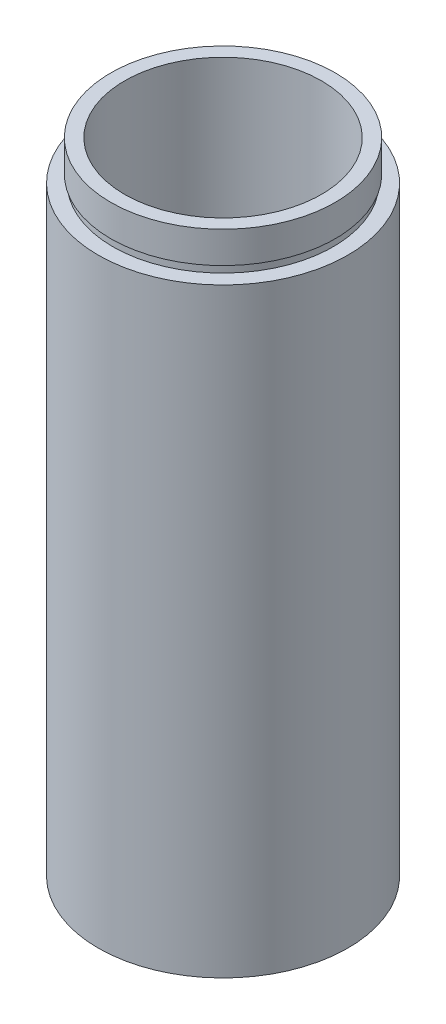
ISO-10303-21;
HEADER;
FILE_DESCRIPTION(('STEP AP214'),'2;1');
FILE_NAME('part.step','',(''),(''),'','','');
FILE_SCHEMA(('AUTOMOTIVE_DESIGN { 1 0 10303 214 1 1 1 1 }'));
ENDSEC;
DATA;
#1=APPLICATION_CONTEXT('core data for automotive mechanical design processes');
#2=APPLICATION_PROTOCOL_DEFINITION('international standard','automotive_design',2000,#1);
#3=PRODUCT_CONTEXT('',#1,'mechanical');
#4=PRODUCT('Part','Part','',(#3));
#5=PRODUCT_RELATED_PRODUCT_CATEGORY('part','',(#4));
#6=PRODUCT_DEFINITION_FORMATION('','',#4);
#7=PRODUCT_DEFINITION_CONTEXT('part definition',#1,'design');
#8=PRODUCT_DEFINITION('design','',#6,#7);
#9=PRODUCT_DEFINITION_SHAPE('','',#8);
#10=(LENGTH_UNIT() NAMED_UNIT(*) SI_UNIT(.MILLI.,.METRE.));
#11=(NAMED_UNIT(*) PLANE_ANGLE_UNIT() SI_UNIT($,.RADIAN.));
#12=(NAMED_UNIT(*) SI_UNIT($,.STERADIAN.) SOLID_ANGLE_UNIT());
#13=UNCERTAINTY_MEASURE_WITH_UNIT(LENGTH_MEASURE(1.E-05),#10,'distance_accuracy_value','');
#14=(GEOMETRIC_REPRESENTATION_CONTEXT(3) GLOBAL_UNCERTAINTY_ASSIGNED_CONTEXT((#13)) GLOBAL_UNIT_ASSIGNED_CONTEXT((#10,
#11,#12)) REPRESENTATION_CONTEXT('',''));
#15=CARTESIAN_POINT('',(0.,0.,0.));
#16=DIRECTION('',(0.,0.,1.));
#17=DIRECTION('',(1.,0.,0.));
#18=AXIS2_PLACEMENT_3D('',#15,#16,#17);
#19=CARTESIAN_POINT('',(14.25,0.,0.));
#20=DIRECTION('',(0.,1.,0.));
#21=DIRECTION('',(0.,0.,1.));
#22=AXIS2_PLACEMENT_3D('',#19,#20,#21);
#23=PLANE('',#22);
#24=CARTESIAN_POINT('',(0.,0.,0.));
#25=DIRECTION('',(0.,1.,0.));
#26=DIRECTION('',(0.,0.,1.));
#27=AXIS2_PLACEMENT_3D('',#24,#25,#26);
#28=CIRCLE('',#27,15.85);
#29=CARTESIAN_POINT('',(0.,0.,15.85));
#30=VERTEX_POINT('',#29);
#31=EDGE_CURVE('E10',#30,#30,#28,.T.);
#32=ORIENTED_EDGE('',*,*,#31,.F.);
#33=EDGE_LOOP('',(#32));
#34=FACE_BOUND('',#33,.T.);
#35=CARTESIAN_POINT('',(0.,0.,0.));
#36=DIRECTION('',(0.,1.,0.));
#37=DIRECTION('',(0.,0.,1.));
#38=AXIS2_PLACEMENT_3D('',#35,#36,#37);
#39=CIRCLE('',#38,14.25);
#40=CARTESIAN_POINT('',(0.,0.,14.25));
#41=VERTEX_POINT('',#40);
#42=EDGE_CURVE('E75',#41,#41,#39,.T.);
#43=ORIENTED_EDGE('',*,*,#42,.T.);
#44=EDGE_LOOP('',(#43));
#45=FACE_BOUND('',#44,.T.);
#46=ADVANCED_FACE('F35',(#34,#45),#23,.F.);
#47=CARTESIAN_POINT('',(0.,161.376166943427,0.));
#48=DIRECTION('',(0.,1.,0.));
#49=DIRECTION('',(0.,0.,1.));
#50=AXIS2_PLACEMENT_3D('',#47,#48,#49);
#51=CYLINDRICAL_SURFACE('',#50,15.85);
#52=CARTESIAN_POINT('',(0.,76.2,0.));
#53=DIRECTION('',(0.,1.,0.));
#54=DIRECTION('',(0.,0.,1.));
#55=AXIS2_PLACEMENT_3D('',#52,#53,#54);
#56=CIRCLE('',#55,15.85);
#57=CARTESIAN_POINT('',(0.,76.2,15.85));
#58=VERTEX_POINT('',#57);
#59=EDGE_CURVE('E41',#58,#58,#56,.T.);
#60=ORIENTED_EDGE('',*,*,#59,.F.);
#61=EDGE_LOOP('',(#60));
#62=FACE_BOUND('',#61,.T.);
#63=ORIENTED_EDGE('',*,*,#31,.T.);
#64=EDGE_LOOP('',(#63));
#65=FACE_BOUND('',#64,.T.);
#66=ADVANCED_FACE('F136',(#62,#65),#51,.T.);
#67=CARTESIAN_POINT('',(14.,76.2,0.));
#68=DIRECTION('',(0.,-1.,0.));
#69=DIRECTION('',(0.,0.,-1.));
#70=AXIS2_PLACEMENT_3D('',#67,#68,#69);
#71=PLANE('',#70);
#72=CARTESIAN_POINT('',(0.,76.2,0.));
#73=DIRECTION('',(0.,1.,0.));
#74=DIRECTION('',(0.,0.,1.));
#75=AXIS2_PLACEMENT_3D('',#72,#73,#74);
#76=CIRCLE('',#75,14.);
#77=CARTESIAN_POINT('',(0.,76.2,14.));
#78=VERTEX_POINT('',#77);
#79=EDGE_CURVE('E45',#78,#78,#76,.T.);
#80=ORIENTED_EDGE('',*,*,#79,.F.);
#81=EDGE_LOOP('',(#80));
#82=FACE_BOUND('',#81,.T.);
#83=ORIENTED_EDGE('',*,*,#59,.T.);
#84=EDGE_LOOP('',(#83));
#85=FACE_BOUND('',#84,.T.);
#86=ADVANCED_FACE('F131',(#82,#85),#71,.F.);
#87=CARTESIAN_POINT('',(0.,161.376166943427,0.));
#88=DIRECTION('',(0.,1.,0.));
#89=DIRECTION('',(0.,0.,1.));
#90=AXIS2_PLACEMENT_3D('',#87,#88,#89);
#91=CYLINDRICAL_SURFACE('',#90,14.);
#92=CARTESIAN_POINT('',(0.,77.2,0.));
#93=DIRECTION('',(0.,1.,0.));
#94=DIRECTION('',(0.,0.,1.));
#95=AXIS2_PLACEMENT_3D('',#92,#93,#94);
#96=CIRCLE('',#95,14.);
#97=CARTESIAN_POINT('',(0.,77.2,14.));
#98=VERTEX_POINT('',#97);
#99=EDGE_CURVE('E49',#98,#98,#96,.T.);
#100=ORIENTED_EDGE('',*,*,#99,.F.);
#101=EDGE_LOOP('',(#100));
#102=FACE_BOUND('',#101,.T.);
#103=ORIENTED_EDGE('',*,*,#79,.T.);
#104=EDGE_LOOP('',(#103));
#105=FACE_BOUND('',#104,.T.);
#106=ADVANCED_FACE('F125',(#102,#105),#91,.T.);
#107=CARTESIAN_POINT('',(14.,77.2,0.));
#108=DIRECTION('',(0.,1.,0.));
#109=DIRECTION('',(0.,0.,1.));
#110=AXIS2_PLACEMENT_3D('',#107,#108,#109);
#111=PLANE('',#110);
#112=CARTESIAN_POINT('',(0.,77.2,0.));
#113=DIRECTION('',(0.,1.,0.));
#114=DIRECTION('',(0.,0.,1.));
#115=AXIS2_PLACEMENT_3D('',#112,#113,#114);
#116=CIRCLE('',#115,14.25);
#117=CARTESIAN_POINT('',(0.,77.2,14.25));
#118=VERTEX_POINT('',#117);
#119=EDGE_CURVE('E54',#118,#118,#116,.T.);
#120=ORIENTED_EDGE('',*,*,#119,.F.);
#121=EDGE_LOOP('',(#120));
#122=FACE_BOUND('',#121,.T.);
#123=ORIENTED_EDGE('',*,*,#99,.T.);
#124=EDGE_LOOP('',(#123));
#125=FACE_BOUND('',#124,.T.);
#126=ADVANCED_FACE('F119',(#122,#125),#111,.F.);
#127=CARTESIAN_POINT('',(0.,161.376166943427,0.));
#128=DIRECTION('',(0.,1.,0.));
#129=DIRECTION('',(0.,0.,1.));
#130=AXIS2_PLACEMENT_3D('',#127,#128,#129);
#131=CYLINDRICAL_SURFACE('',#130,14.25);
#132=CARTESIAN_POINT('',(0.,81.2,0.));
#133=DIRECTION('',(0.,1.,0.));
#134=DIRECTION('',(0.,0.,1.));
#135=AXIS2_PLACEMENT_3D('',#132,#133,#134);
#136=CIRCLE('',#135,14.25);
#137=CARTESIAN_POINT('',(0.,81.2,14.25));
#138=VERTEX_POINT('',#137);
#139=EDGE_CURVE('E57',#138,#138,#136,.T.);
#140=ORIENTED_EDGE('',*,*,#139,.F.);
#141=EDGE_LOOP('',(#140));
#142=FACE_BOUND('',#141,.T.);
#143=ORIENTED_EDGE('',*,*,#119,.T.);
#144=EDGE_LOOP('',(#143));
#145=FACE_BOUND('',#144,.T.);
#146=ADVANCED_FACE('F113',(#142,#145),#131,.T.);
#147=CARTESIAN_POINT('',(12.5,81.2,0.));
#148=DIRECTION('',(0.,-1.,0.));
#149=DIRECTION('',(0.,0.,-1.));
#150=AXIS2_PLACEMENT_3D('',#147,#148,#149);
#151=PLANE('',#150);
#152=CARTESIAN_POINT('',(0.,81.2,0.));
#153=DIRECTION('',(0.,1.,0.));
#154=DIRECTION('',(0.,0.,1.));
#155=AXIS2_PLACEMENT_3D('',#152,#153,#154);
#156=CIRCLE('',#155,12.5);
#157=CARTESIAN_POINT('',(0.,81.2,12.5));
#158=VERTEX_POINT('',#157);
#159=EDGE_CURVE('E60',#158,#158,#156,.T.);
#160=ORIENTED_EDGE('',*,*,#159,.F.);
#161=EDGE_LOOP('',(#160));
#162=FACE_BOUND('',#161,.T.);
#163=ORIENTED_EDGE('',*,*,#139,.T.);
#164=EDGE_LOOP('',(#163));
#165=FACE_BOUND('',#164,.T.);
#166=ADVANCED_FACE('F107',(#162,#165),#151,.F.);
#167=CARTESIAN_POINT('',(0.,161.376166943427,0.));
#168=DIRECTION('',(0.,1.,0.));
#169=DIRECTION('',(0.,0.,1.));
#170=AXIS2_PLACEMENT_3D('',#167,#168,#169);
#171=CYLINDRICAL_SURFACE('',#170,12.5);
#172=CARTESIAN_POINT('',(0.,5.49999999999998,0.));
#173=DIRECTION('',(0.,1.,0.));
#174=DIRECTION('',(0.,0.,1.));
#175=AXIS2_PLACEMENT_3D('',#172,#173,#174);
#176=CIRCLE('',#175,12.5);
#177=CARTESIAN_POINT('',(0.,5.49999999999998,12.5));
#178=VERTEX_POINT('',#177);
#179=EDGE_CURVE('E63',#178,#178,#176,.T.);
#180=ORIENTED_EDGE('',*,*,#179,.F.);
#181=EDGE_LOOP('',(#180));
#182=FACE_BOUND('',#181,.T.);
#183=ORIENTED_EDGE('',*,*,#159,.T.);
#184=EDGE_LOOP('',(#183));
#185=FACE_BOUND('',#184,.T.);
#186=ADVANCED_FACE('F101',(#182,#185),#171,.F.);
#187=CARTESIAN_POINT('',(12.5,5.49999999999998,0.));
#188=DIRECTION('',(0.,1.,0.));
#189=DIRECTION('',(0.,0.,1.));
#190=AXIS2_PLACEMENT_3D('',#187,#188,#189);
#191=PLANE('',#190);
#192=CARTESIAN_POINT('',(0.,5.49999999999998,0.));
#193=DIRECTION('',(0.,1.,0.));
#194=DIRECTION('',(0.,0.,1.));
#195=AXIS2_PLACEMENT_3D('',#192,#193,#194);
#196=CIRCLE('',#195,14.35);
#197=CARTESIAN_POINT('',(0.,5.49999999999998,14.35));
#198=VERTEX_POINT('',#197);
#199=EDGE_CURVE('E66',#198,#198,#196,.T.);
#200=ORIENTED_EDGE('',*,*,#199,.F.);
#201=EDGE_LOOP('',(#200));
#202=FACE_BOUND('',#201,.T.);
#203=ORIENTED_EDGE('',*,*,#179,.T.);
#204=EDGE_LOOP('',(#203));
#205=FACE_BOUND('',#204,.T.);
#206=ADVANCED_FACE('F95',(#202,#205),#191,.F.);
#207=CARTESIAN_POINT('',(0.,161.376166943427,0.));
#208=DIRECTION('',(0.,1.,0.));
#209=DIRECTION('',(0.,0.,1.));
#210=AXIS2_PLACEMENT_3D('',#207,#208,#209);
#211=CYLINDRICAL_SURFACE('',#210,14.35);
#212=CARTESIAN_POINT('',(0.,4.49999999999998,0.));
#213=DIRECTION('',(0.,1.,0.));
#214=DIRECTION('',(0.,0.,1.));
#215=AXIS2_PLACEMENT_3D('',#212,#213,#214);
#216=CIRCLE('',#215,14.35);
#217=CARTESIAN_POINT('',(0.,4.49999999999998,14.35));
#218=VERTEX_POINT('',#217);
#219=EDGE_CURVE('E69',#218,#218,#216,.T.);
#220=ORIENTED_EDGE('',*,*,#219,.F.);
#221=EDGE_LOOP('',(#220));
#222=FACE_BOUND('',#221,.T.);
#223=ORIENTED_EDGE('',*,*,#199,.T.);
#224=EDGE_LOOP('',(#223));
#225=FACE_BOUND('',#224,.T.);
#226=ADVANCED_FACE('F89',(#222,#225),#211,.F.);
#227=CARTESIAN_POINT('',(14.25,4.50000000000001,0.));
#228=DIRECTION('',(0.,-1.,0.));
#229=DIRECTION('',(0.,0.,-1.));
#230=AXIS2_PLACEMENT_3D('',#227,#228,#229);
#231=PLANE('',#230);
#232=CARTESIAN_POINT('',(0.,4.50000000000003,0.));
#233=DIRECTION('',(0.,1.,0.));
#234=DIRECTION('',(0.,0.,1.));
#235=AXIS2_PLACEMENT_3D('',#232,#233,#234);
#236=CIRCLE('',#235,14.25);
#237=CARTESIAN_POINT('',(0.,4.50000000000003,14.25));
#238=VERTEX_POINT('',#237);
#239=EDGE_CURVE('E72',#238,#238,#236,.T.);
#240=ORIENTED_EDGE('',*,*,#239,.F.);
#241=EDGE_LOOP('',(#240));
#242=FACE_BOUND('',#241,.T.);
#243=ORIENTED_EDGE('',*,*,#219,.T.);
#244=EDGE_LOOP('',(#243));
#245=FACE_BOUND('',#244,.T.);
#246=ADVANCED_FACE('F83',(#242,#245),#231,.F.);
#247=CARTESIAN_POINT('',(0.,161.376166943427,0.));
#248=DIRECTION('',(0.,1.,0.));
#249=DIRECTION('',(0.,0.,1.));
#250=AXIS2_PLACEMENT_3D('',#247,#248,#249);
#251=CYLINDRICAL_SURFACE('',#250,14.25);
#252=ORIENTED_EDGE('',*,*,#42,.F.);
#253=EDGE_LOOP('',(#252));
#254=FACE_BOUND('',#253,.T.);
#255=ORIENTED_EDGE('',*,*,#239,.T.);
#256=EDGE_LOOP('',(#255));
#257=FACE_BOUND('',#256,.T.);
#258=ADVANCED_FACE('F80',(#254,#257),#251,.F.);
#259=CLOSED_SHELL('',(#46,#66,#86,#106,#126,#146,#166,#186,#206,#226,#246,#258));
#260=MANIFOLD_SOLID_BREP('B2',#259);
#261=ADVANCED_BREP_SHAPE_REPRESENTATION('',(#18,#260),#14);
#262=SHAPE_DEFINITION_REPRESENTATION(#9,#261);
ENDSEC;
END-ISO-10303-21;
